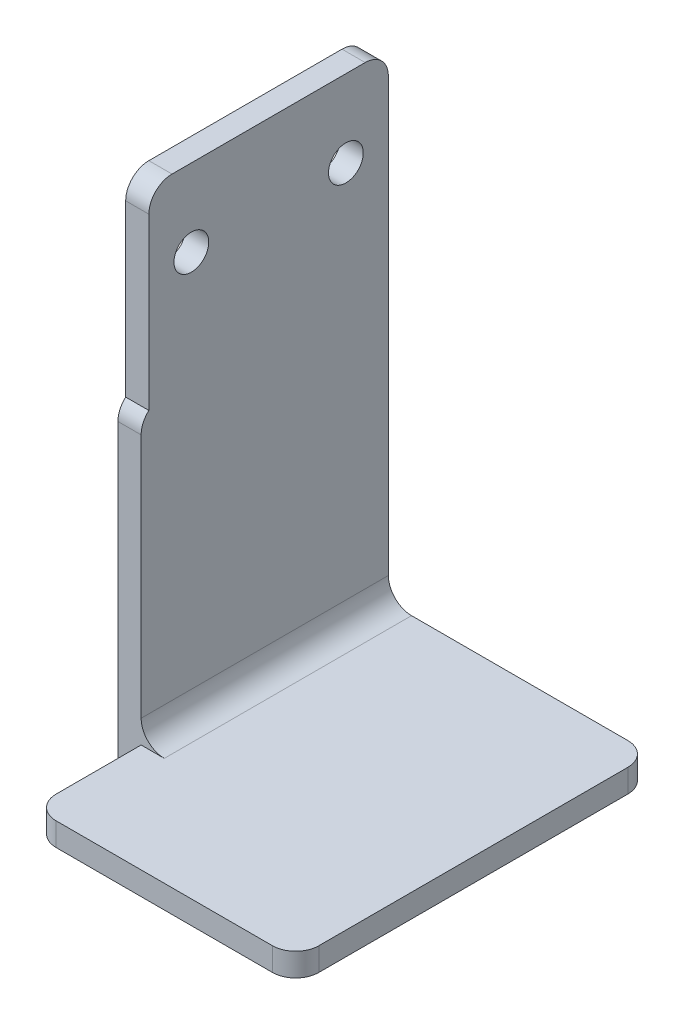
ISO-10303-21;
HEADER;
FILE_DESCRIPTION(('STEP AP214'),'2;1');
FILE_NAME('part.step','',(''),(''),'','','');
FILE_SCHEMA(('AUTOMOTIVE_DESIGN { 1 0 10303 214 1 1 1 1 }'));
ENDSEC;
DATA;
#1=APPLICATION_CONTEXT('core data for automotive mechanical design processes');
#2=APPLICATION_PROTOCOL_DEFINITION('international standard','automotive_design',2000,#1);
#3=PRODUCT_CONTEXT('',#1,'mechanical');
#4=PRODUCT('Part','Part','',(#3));
#5=PRODUCT_RELATED_PRODUCT_CATEGORY('part','',(#4));
#6=PRODUCT_DEFINITION_FORMATION('','',#4);
#7=PRODUCT_DEFINITION_CONTEXT('part definition',#1,'design');
#8=PRODUCT_DEFINITION('design','',#6,#7);
#9=PRODUCT_DEFINITION_SHAPE('','',#8);
#10=(LENGTH_UNIT() NAMED_UNIT(*) SI_UNIT(.MILLI.,.METRE.));
#11=(NAMED_UNIT(*) PLANE_ANGLE_UNIT() SI_UNIT($,.RADIAN.));
#12=(NAMED_UNIT(*) SI_UNIT($,.STERADIAN.) SOLID_ANGLE_UNIT());
#13=UNCERTAINTY_MEASURE_WITH_UNIT(LENGTH_MEASURE(1.E-05),#10,'distance_accuracy_value','');
#14=(GEOMETRIC_REPRESENTATION_CONTEXT(3) GLOBAL_UNCERTAINTY_ASSIGNED_CONTEXT((#13)) GLOBAL_UNIT_ASSIGNED_CONTEXT((#10,
#11,#12)) REPRESENTATION_CONTEXT('',''));
#15=CARTESIAN_POINT('',(0.,0.,0.));
#16=DIRECTION('',(0.,0.,1.));
#17=DIRECTION('',(1.,0.,0.));
#18=AXIS2_PLACEMENT_3D('',#15,#16,#17);
#19=CARTESIAN_POINT('',(0.,0.,46.));
#20=DIRECTION('',(0.,0.,-1.));
#21=DIRECTION('',(-1.,0.,0.));
#22=AXIS2_PLACEMENT_3D('',#19,#20,#21);
#23=PLANE('',#22);
#24=DIRECTION('',(-1.,0.,0.));
#25=VECTOR('',#24,1.);
#26=CARTESIAN_POINT('',(3.00000000000001,3.,46.));
#27=LINE('',#26,#25);
#28=CARTESIAN_POINT('',(34.,3.,46.));
#29=VERTEX_POINT('',#28);
#30=CARTESIAN_POINT('',(6.,3.,46.));
#31=VERTEX_POINT('',#30);
#32=EDGE_CURVE('E253',#29,#31,#27,.T.);
#33=ORIENTED_EDGE('',*,*,#32,.T.);
#34=DIRECTION('',(0.,1.,0.));
#35=VECTOR('',#34,1.);
#36=CARTESIAN_POINT('',(6.,0.,46.));
#37=LINE('',#36,#35);
#38=CARTESIAN_POINT('',(6.00000000000001,0.,46.));
#39=VERTEX_POINT('',#38);
#40=EDGE_CURVE('E202',#31,#39,#37,.F.);
#41=ORIENTED_EDGE('',*,*,#40,.T.);
#42=DIRECTION('',(1.,0.,0.));
#43=VECTOR('',#42,1.);
#44=CARTESIAN_POINT('',(37.,0.,46.));
#45=LINE('',#44,#43);
#46=CARTESIAN_POINT('',(34.,0.,46.));
#47=VERTEX_POINT('',#46);
#48=EDGE_CURVE('E250',#39,#47,#45,.T.);
#49=ORIENTED_EDGE('',*,*,#48,.T.);
#50=DIRECTION('',(0.,1.,0.));
#51=VECTOR('',#50,1.);
#52=CARTESIAN_POINT('',(34.,0.,46.));
#53=LINE('',#52,#51);
#54=EDGE_CURVE('E199',#47,#29,#53,.T.);
#55=ORIENTED_EDGE('',*,*,#54,.T.);
#56=EDGE_LOOP('',(#33,#41,#49,#55));
#57=FACE_BOUND('',#56,.T.);
#58=ADVANCED_FACE('F33',(#57),#23,.F.);
#59=CARTESIAN_POINT('',(37.,0.,46.));
#60=DIRECTION('',(0.,1.,0.));
#61=DIRECTION('',(-1.,0.,0.));
#62=AXIS2_PLACEMENT_3D('',#59,#60,#61);
#63=PLANE('',#62);
#64=ORIENTED_EDGE('',*,*,#48,.F.);
#65=CARTESIAN_POINT('',(6.,0.,43.));
#66=DIRECTION('',(0.,1.,0.));
#67=DIRECTION('',(-1.,0.,0.));
#68=AXIS2_PLACEMENT_3D('',#65,#66,#67);
#69=CIRCLE('',#68,3.);
#70=CARTESIAN_POINT('',(3.,0.,43.));
#71=VERTEX_POINT('',#70);
#72=EDGE_CURVE('E207',#39,#71,#69,.F.);
#73=ORIENTED_EDGE('',*,*,#72,.T.);
#74=DIRECTION('',(0.,0.,1.));
#75=VECTOR('',#74,1.);
#76=CARTESIAN_POINT('',(3.,0.,32.));
#77=LINE('',#76,#75);
#78=CARTESIAN_POINT('',(3.,0.,32.));
#79=VERTEX_POINT('',#78);
#80=EDGE_CURVE('E170',#79,#71,#77,.T.);
#81=ORIENTED_EDGE('',*,*,#80,.F.);
#82=DIRECTION('',(-1.,0.,0.));
#83=VECTOR('',#82,1.);
#84=CARTESIAN_POINT('',(3.,0.,32.));
#85=LINE('',#84,#83);
#86=CARTESIAN_POINT('',(0.,0.,32.));
#87=VERTEX_POINT('',#86);
#88=EDGE_CURVE('E169',#79,#87,#85,.T.);
#89=ORIENTED_EDGE('',*,*,#88,.T.);
#90=DIRECTION('',(0.,0.,-1.));
#91=VECTOR('',#90,1.);
#92=CARTESIAN_POINT('',(0.,0.,46.));
#93=LINE('',#92,#91);
#94=CARTESIAN_POINT('',(0.,0.,0.));
#95=VERTEX_POINT('',#94);
#96=EDGE_CURVE('E257',#87,#95,#93,.T.);
#97=ORIENTED_EDGE('',*,*,#96,.T.);
#98=DIRECTION('',(1.,0.,0.));
#99=VECTOR('',#98,1.);
#100=CARTESIAN_POINT('',(37.,0.,0.));
#101=LINE('',#100,#99);
#102=CARTESIAN_POINT('',(34.,0.,0.));
#103=VERTEX_POINT('',#102);
#104=EDGE_CURVE('E233',#95,#103,#101,.T.);
#105=ORIENTED_EDGE('',*,*,#104,.T.);
#106=CARTESIAN_POINT('',(34.,0.,3.));
#107=DIRECTION('',(0.,1.,0.));
#108=DIRECTION('',(-1.,0.,0.));
#109=AXIS2_PLACEMENT_3D('',#106,#107,#108);
#110=CIRCLE('',#109,3.);
#111=CARTESIAN_POINT('',(37.,0.,3.));
#112=VERTEX_POINT('',#111);
#113=EDGE_CURVE('E48',#103,#112,#110,.F.);
#114=ORIENTED_EDGE('',*,*,#113,.T.);
#115=DIRECTION('',(0.,0.,-1.));
#116=VECTOR('',#115,1.);
#117=CARTESIAN_POINT('',(37.,0.,46.));
#118=LINE('',#117,#116);
#119=CARTESIAN_POINT('',(37.,0.,43.));
#120=VERTEX_POINT('',#119);
#121=EDGE_CURVE('E274',#120,#112,#118,.T.);
#122=ORIENTED_EDGE('',*,*,#121,.F.);
#123=CARTESIAN_POINT('',(34.,0.,43.));
#124=DIRECTION('',(0.,1.,0.));
#125=DIRECTION('',(-1.,0.,0.));
#126=AXIS2_PLACEMENT_3D('',#123,#124,#125);
#127=CIRCLE('',#126,3.);
#128=EDGE_CURVE('E205',#120,#47,#127,.F.);
#129=ORIENTED_EDGE('',*,*,#128,.T.);
#130=EDGE_LOOP('',(#64,#73,#81,#89,#97,#105,#114,#122,#129));
#131=FACE_BOUND('',#130,.T.);
#132=ADVANCED_FACE('F308',(#131),#63,.F.);
#133=CARTESIAN_POINT('',(37.,3.,46.));
#134=DIRECTION('',(-1.,0.,0.));
#135=DIRECTION('',(0.,0.,1.));
#136=AXIS2_PLACEMENT_3D('',#133,#134,#135);
#137=PLANE('',#136);
#138=DIRECTION('',(0.,0.,-1.));
#139=VECTOR('',#138,1.);
#140=CARTESIAN_POINT('',(37.,3.,46.));
#141=LINE('',#140,#139);
#142=CARTESIAN_POINT('',(37.,3.,43.));
#143=VERTEX_POINT('',#142);
#144=CARTESIAN_POINT('',(37.,3.,3.));
#145=VERTEX_POINT('',#144);
#146=EDGE_CURVE('E272',#143,#145,#141,.T.);
#147=ORIENTED_EDGE('',*,*,#146,.F.);
#148=DIRECTION('',(0.,1.,0.));
#149=VECTOR('',#148,1.);
#150=CARTESIAN_POINT('',(37.,3.,43.));
#151=LINE('',#150,#149);
#152=EDGE_CURVE('E55',#143,#120,#151,.F.);
#153=ORIENTED_EDGE('',*,*,#152,.T.);
#154=ORIENTED_EDGE('',*,*,#121,.T.);
#155=DIRECTION('',(0.,1.,0.));
#156=VECTOR('',#155,1.);
#157=CARTESIAN_POINT('',(37.,3.,3.));
#158=LINE('',#157,#156);
#159=EDGE_CURVE('E213',#112,#145,#158,.T.);
#160=ORIENTED_EDGE('',*,*,#159,.T.);
#161=EDGE_LOOP('',(#147,#153,#154,#160));
#162=FACE_BOUND('',#161,.T.);
#163=ADVANCED_FACE('F311',(#162),#137,.F.);
#164=CARTESIAN_POINT('',(3.00000000000001,3.,46.));
#165=DIRECTION('',(0.,-1.,0.));
#166=DIRECTION('',(1.,0.,0.));
#167=AXIS2_PLACEMENT_3D('',#164,#165,#166);
#168=PLANE('',#167);
#169=DIRECTION('',(-1.,0.,0.));
#170=VECTOR('',#169,1.);
#171=CARTESIAN_POINT('',(3.00000000000001,3.,0.));
#172=LINE('',#171,#170);
#173=CARTESIAN_POINT('',(34.,3.,0.));
#174=VERTEX_POINT('',#173);
#175=CARTESIAN_POINT('',(6.00000000000001,3.,0.));
#176=VERTEX_POINT('',#175);
#177=EDGE_CURVE('E222',#174,#176,#172,.T.);
#178=ORIENTED_EDGE('',*,*,#177,.T.);
#179=DIRECTION('',(0.,0.,-1.));
#180=VECTOR('',#179,1.);
#181=CARTESIAN_POINT('',(6.00000000000001,3.,32.));
#182=LINE('',#181,#180);
#183=CARTESIAN_POINT('',(6.00000000000001,3.,32.));
#184=VERTEX_POINT('',#183);
#185=EDGE_CURVE('E193',#176,#184,#182,.F.);
#186=ORIENTED_EDGE('',*,*,#185,.T.);
#187=DIRECTION('',(-1.,0.,0.));
#188=VECTOR('',#187,1.);
#189=CARTESIAN_POINT('',(3.,3.,32.));
#190=LINE('',#189,#188);
#191=CARTESIAN_POINT('',(3.,3.,32.));
#192=VERTEX_POINT('',#191);
#193=EDGE_CURVE('E191',#184,#192,#190,.T.);
#194=ORIENTED_EDGE('',*,*,#193,.T.);
#195=DIRECTION('',(0.,0.,-1.));
#196=VECTOR('',#195,1.);
#197=CARTESIAN_POINT('',(3.00000000000001,3.,46.));
#198=LINE('',#197,#196);
#199=CARTESIAN_POINT('',(3.00000000000001,3.,43.));
#200=VERTEX_POINT('',#199);
#201=EDGE_CURVE('E269',#200,#192,#198,.T.);
#202=ORIENTED_EDGE('',*,*,#201,.F.);
#203=CARTESIAN_POINT('',(6.,3.,43.));
#204=DIRECTION('',(0.,-1.,0.));
#205=DIRECTION('',(1.,0.,0.));
#206=AXIS2_PLACEMENT_3D('',#203,#204,#205);
#207=CIRCLE('',#206,3.);
#208=EDGE_CURVE('E189',#200,#31,#207,.F.);
#209=ORIENTED_EDGE('',*,*,#208,.T.);
#210=ORIENTED_EDGE('',*,*,#32,.F.);
#211=CARTESIAN_POINT('',(34.,3.,43.));
#212=DIRECTION('',(0.,-1.,0.));
#213=DIRECTION('',(1.,0.,0.));
#214=AXIS2_PLACEMENT_3D('',#211,#212,#213);
#215=CIRCLE('',#214,3.);
#216=EDGE_CURVE('E187',#29,#143,#215,.F.);
#217=ORIENTED_EDGE('',*,*,#216,.T.);
#218=ORIENTED_EDGE('',*,*,#146,.T.);
#219=CARTESIAN_POINT('',(34.,3.,3.));
#220=DIRECTION('',(0.,-1.,0.));
#221=DIRECTION('',(1.,0.,0.));
#222=AXIS2_PLACEMENT_3D('',#219,#220,#221);
#223=CIRCLE('',#222,3.);
#224=EDGE_CURVE('E185',#145,#174,#223,.F.);
#225=ORIENTED_EDGE('',*,*,#224,.T.);
#226=EDGE_LOOP('',(#178,#186,#194,#202,#209,#210,#217,#218,#225));
#227=FACE_BOUND('',#226,.T.);
#228=ADVANCED_FACE('F230',(#227),#168,.F.);
#229=CARTESIAN_POINT('',(3.,65.,46.));
#230=DIRECTION('',(-1.,0.,0.));
#231=DIRECTION('',(0.,-1.,0.));
#232=AXIS2_PLACEMENT_3D('',#229,#230,#231);
#233=PLANE('',#232);
#234=CARTESIAN_POINT('',(3.,55.,25.5));
#235=DIRECTION('',(1.,0.,0.));
#236=DIRECTION('',(0.,1.,0.));
#237=AXIS2_PLACEMENT_3D('',#234,#235,#236);
#238=CIRCLE('',#237,2.25);
#239=CARTESIAN_POINT('',(3.,57.25,25.5));
#240=VERTEX_POINT('',#239);
#241=EDGE_CURVE('E280',#240,#240,#238,.T.);
#242=ORIENTED_EDGE('',*,*,#241,.F.);
#243=EDGE_LOOP('',(#242));
#244=FACE_BOUND('',#243,.T.);
#245=CARTESIAN_POINT('',(3.,55.,5.5));
#246=DIRECTION('',(1.,0.,0.));
#247=DIRECTION('',(0.,1.,0.));
#248=AXIS2_PLACEMENT_3D('',#245,#246,#247);
#249=CIRCLE('',#248,2.25);
#250=CARTESIAN_POINT('',(3.,57.25,5.5));
#251=VERTEX_POINT('',#250);
#252=EDGE_CURVE('E498',#251,#251,#249,.T.);
#253=ORIENTED_EDGE('',*,*,#252,.F.);
#254=EDGE_LOOP('',(#253));
#255=FACE_BOUND('',#254,.T.);
#256=DIRECTION('',(0.,0.,-1.));
#257=VECTOR('',#256,1.);
#258=CARTESIAN_POINT('',(3.,65.,46.));
#259=LINE('',#258,#257);
#260=CARTESIAN_POINT('',(3.,65.,28.));
#261=VERTEX_POINT('',#260);
#262=CARTESIAN_POINT('',(3.,65.,3.));
#263=VERTEX_POINT('',#262);
#264=EDGE_CURVE('E266',#261,#263,#259,.T.);
#265=ORIENTED_EDGE('',*,*,#264,.F.);
#266=CARTESIAN_POINT('',(3.,62.,28.));
#267=DIRECTION('',(-1.,0.,0.));
#268=DIRECTION('',(0.,-1.,0.));
#269=AXIS2_PLACEMENT_3D('',#266,#267,#268);
#270=CIRCLE('',#269,3.);
#271=CARTESIAN_POINT('',(3.,62.,31.));
#272=VERTEX_POINT('',#271);
#273=EDGE_CURVE('E155',#261,#272,#270,.F.);
#274=ORIENTED_EDGE('',*,*,#273,.T.);
#275=DIRECTION('',(0.,-1.,0.));
#276=VECTOR('',#275,1.);
#277=CARTESIAN_POINT('',(3.,40.,31.));
#278=LINE('',#277,#276);
#279=CARTESIAN_POINT('',(3.,40.,31.));
#280=VERTEX_POINT('',#279);
#281=EDGE_CURVE('E146',#272,#280,#278,.T.);
#282=ORIENTED_EDGE('',*,*,#281,.T.);
#283=CARTESIAN_POINT('',(3.,37.7639320225002,29.));
#284=DIRECTION('',(-1.,0.,0.));
#285=DIRECTION('',(0.,-1.,0.));
#286=AXIS2_PLACEMENT_3D('',#283,#284,#285);
#287=CIRCLE('',#286,3.);
#288=CARTESIAN_POINT('',(3.,37.7639320225002,32.));
#289=VERTEX_POINT('',#288);
#290=EDGE_CURVE('E152',#280,#289,#287,.F.);
#291=ORIENTED_EDGE('',*,*,#290,.T.);
#292=DIRECTION('',(0.,-1.,0.));
#293=VECTOR('',#292,1.);
#294=CARTESIAN_POINT('',(3.,0.,32.));
#295=LINE('',#294,#293);
#296=CARTESIAN_POINT('',(3.,6.,32.));
#297=VERTEX_POINT('',#296);
#298=EDGE_CURVE('E238',#289,#297,#295,.T.);
#299=ORIENTED_EDGE('',*,*,#298,.T.);
#300=DIRECTION('',(0.,0.,-1.));
#301=VECTOR('',#300,1.);
#302=CARTESIAN_POINT('',(3.00000000000001,6.,0.));
#303=LINE('',#302,#301);
#304=CARTESIAN_POINT('',(3.00000000000001,6.,0.));
#305=VERTEX_POINT('',#304);
#306=EDGE_CURVE('E176',#297,#305,#303,.T.);
#307=ORIENTED_EDGE('',*,*,#306,.T.);
#308=DIRECTION('',(0.,1.,0.));
#309=VECTOR('',#308,1.);
#310=CARTESIAN_POINT('',(3.,65.,0.));
#311=LINE('',#310,#309);
#312=CARTESIAN_POINT('',(3.,62.,0.));
#313=VERTEX_POINT('',#312);
#314=EDGE_CURVE('E225',#305,#313,#311,.T.);
#315=ORIENTED_EDGE('',*,*,#314,.T.);
#316=CARTESIAN_POINT('',(3.,62.,3.));
#317=DIRECTION('',(-1.,0.,0.));
#318=DIRECTION('',(0.,-1.,0.));
#319=AXIS2_PLACEMENT_3D('',#316,#317,#318);
#320=CIRCLE('',#319,3.);
#321=EDGE_CURVE('E180',#313,#263,#320,.F.);
#322=ORIENTED_EDGE('',*,*,#321,.T.);
#323=EDGE_LOOP('',(#265,#274,#282,#291,#299,#307,#315,#322));
#324=FACE_BOUND('',#323,.T.);
#325=ADVANCED_FACE('F149',(#244,#255,#324),#233,.F.);
#326=CARTESIAN_POINT('',(0.,65.,46.));
#327=DIRECTION('',(0.,-1.,0.));
#328=DIRECTION('',(0.,0.,-1.));
#329=AXIS2_PLACEMENT_3D('',#326,#327,#328);
#330=PLANE('',#329);
#331=DIRECTION('',(0.,0.,-1.));
#332=VECTOR('',#331,1.);
#333=CARTESIAN_POINT('',(0.,65.,46.));
#334=LINE('',#333,#332);
#335=CARTESIAN_POINT('',(0.,65.,28.));
#336=VERTEX_POINT('',#335);
#337=CARTESIAN_POINT('',(0.,65.,3.));
#338=VERTEX_POINT('',#337);
#339=EDGE_CURVE('E263',#336,#338,#334,.T.);
#340=ORIENTED_EDGE('',*,*,#339,.F.);
#341=DIRECTION('',(-1.,0.,0.));
#342=VECTOR('',#341,1.);
#343=CARTESIAN_POINT('',(0.,65.,28.));
#344=LINE('',#343,#342);
#345=EDGE_CURVE('E293',#336,#261,#344,.F.);
#346=ORIENTED_EDGE('',*,*,#345,.T.);
#347=ORIENTED_EDGE('',*,*,#264,.T.);
#348=DIRECTION('',(-1.,0.,0.));
#349=VECTOR('',#348,1.);
#350=CARTESIAN_POINT('',(0.,65.,3.));
#351=LINE('',#350,#349);
#352=EDGE_CURVE('E290',#263,#338,#351,.T.);
#353=ORIENTED_EDGE('',*,*,#352,.T.);
#354=EDGE_LOOP('',(#340,#346,#347,#353));
#355=FACE_BOUND('',#354,.T.);
#356=ADVANCED_FACE('F300',(#355),#330,.F.);
#357=CARTESIAN_POINT('',(0.,0.,46.));
#358=DIRECTION('',(1.,0.,0.));
#359=DIRECTION('',(0.,0.,-1.));
#360=AXIS2_PLACEMENT_3D('',#357,#358,#359);
#361=PLANE('',#360);
#362=CARTESIAN_POINT('',(0.,55.,25.5));
#363=DIRECTION('',(1.,0.,0.));
#364=DIRECTION('',(0.,0.,-1.));
#365=AXIS2_PLACEMENT_3D('',#362,#363,#364);
#366=CIRCLE('',#365,2.25);
#367=CARTESIAN_POINT('',(0.,55.,23.25));
#368=VERTEX_POINT('',#367);
#369=EDGE_CURVE('E246',#368,#368,#366,.T.);
#370=ORIENTED_EDGE('',*,*,#369,.T.);
#371=EDGE_LOOP('',(#370));
#372=FACE_BOUND('',#371,.T.);
#373=CARTESIAN_POINT('',(0.,55.,5.5));
#374=DIRECTION('',(1.,0.,0.));
#375=DIRECTION('',(0.,0.,-1.));
#376=AXIS2_PLACEMENT_3D('',#373,#374,#375);
#377=CIRCLE('',#376,2.25);
#378=CARTESIAN_POINT('',(0.,55.,3.25));
#379=VERTEX_POINT('',#378);
#380=EDGE_CURVE('E277',#379,#379,#377,.T.);
#381=ORIENTED_EDGE('',*,*,#380,.T.);
#382=EDGE_LOOP('',(#381));
#383=FACE_BOUND('',#382,.T.);
#384=DIRECTION('',(0.,-1.,0.));
#385=VECTOR('',#384,1.);
#386=CARTESIAN_POINT('',(0.,40.,31.));
#387=LINE('',#386,#385);
#388=CARTESIAN_POINT('',(0.,62.,31.));
#389=VERTEX_POINT('',#388);
#390=CARTESIAN_POINT('',(0.,40.,31.));
#391=VERTEX_POINT('',#390);
#392=EDGE_CURVE('E167',#389,#391,#387,.T.);
#393=ORIENTED_EDGE('',*,*,#392,.F.);
#394=CARTESIAN_POINT('',(0.,62.,28.));
#395=DIRECTION('',(1.,0.,0.));
#396=DIRECTION('',(0.,0.,-1.));
#397=AXIS2_PLACEMENT_3D('',#394,#395,#396);
#398=CIRCLE('',#397,3.);
#399=EDGE_CURVE('E288',#389,#336,#398,.F.);
#400=ORIENTED_EDGE('',*,*,#399,.T.);
#401=ORIENTED_EDGE('',*,*,#339,.T.);
#402=CARTESIAN_POINT('',(0.,62.,3.));
#403=DIRECTION('',(1.,0.,0.));
#404=DIRECTION('',(0.,0.,-1.));
#405=AXIS2_PLACEMENT_3D('',#402,#403,#404);
#406=CIRCLE('',#405,3.);
#407=CARTESIAN_POINT('',(0.,62.,0.));
#408=VERTEX_POINT('',#407);
#409=EDGE_CURVE('E284',#338,#408,#406,.F.);
#410=ORIENTED_EDGE('',*,*,#409,.T.);
#411=DIRECTION('',(0.,-1.,0.));
#412=VECTOR('',#411,1.);
#413=CARTESIAN_POINT('',(0.,0.,0.));
#414=LINE('',#413,#412);
#415=EDGE_CURVE('E254',#408,#95,#414,.T.);
#416=ORIENTED_EDGE('',*,*,#415,.T.);
#417=ORIENTED_EDGE('',*,*,#96,.F.);
#418=DIRECTION('',(0.,-1.,0.));
#419=VECTOR('',#418,1.);
#420=CARTESIAN_POINT('',(0.,0.,32.));
#421=LINE('',#420,#419);
#422=CARTESIAN_POINT('',(0.,37.7639320225002,32.));
#423=VERTEX_POINT('',#422);
#424=EDGE_CURVE('E160',#423,#87,#421,.T.);
#425=ORIENTED_EDGE('',*,*,#424,.F.);
#426=CARTESIAN_POINT('',(0.,37.7639320225002,29.));
#427=DIRECTION('',(1.,0.,0.));
#428=DIRECTION('',(0.,0.,-1.));
#429=AXIS2_PLACEMENT_3D('',#426,#427,#428);
#430=CIRCLE('',#429,3.);
#431=EDGE_CURVE('E286',#423,#391,#430,.F.);
#432=ORIENTED_EDGE('',*,*,#431,.T.);
#433=EDGE_LOOP('',(#393,#400,#401,#410,#416,#417,#425,#432));
#434=FACE_BOUND('',#433,.T.);
#435=ADVANCED_FACE('F304',(#372,#383,#434),#361,.F.);
#436=CARTESIAN_POINT('',(0.,0.,0.));
#437=DIRECTION('',(0.,0.,-1.));
#438=DIRECTION('',(-1.,0.,0.));
#439=AXIS2_PLACEMENT_3D('',#436,#437,#438);
#440=PLANE('',#439);
#441=ORIENTED_EDGE('',*,*,#415,.F.);
#442=DIRECTION('',(-1.,0.,0.));
#443=VECTOR('',#442,1.);
#444=CARTESIAN_POINT('',(3.,62.,0.));
#445=LINE('',#444,#443);
#446=EDGE_CURVE('E211',#408,#313,#445,.F.);
#447=ORIENTED_EDGE('',*,*,#446,.T.);
#448=ORIENTED_EDGE('',*,*,#314,.F.);
#449=CARTESIAN_POINT('',(6.00000000000001,6.,0.));
#450=DIRECTION('',(0.,0.,-1.));
#451=DIRECTION('',(-1.,0.,0.));
#452=AXIS2_PLACEMENT_3D('',#449,#450,#451);
#453=CIRCLE('',#452,3.);
#454=EDGE_CURVE('E41',#305,#176,#453,.F.);
#455=ORIENTED_EDGE('',*,*,#454,.T.);
#456=ORIENTED_EDGE('',*,*,#177,.F.);
#457=DIRECTION('',(0.,1.,0.));
#458=VECTOR('',#457,1.);
#459=CARTESIAN_POINT('',(34.,0.,0.));
#460=LINE('',#459,#458);
#461=EDGE_CURVE('E209',#174,#103,#460,.F.);
#462=ORIENTED_EDGE('',*,*,#461,.T.);
#463=ORIENTED_EDGE('',*,*,#104,.F.);
#464=EDGE_LOOP('',(#441,#447,#448,#455,#456,#462,#463));
#465=FACE_BOUND('',#464,.T.);
#466=ADVANCED_FACE('F221',(#465),#440,.T.);
#467=CARTESIAN_POINT('',(3.,0.,0.));
#468=DIRECTION('',(-1.,0.,0.));
#469=DIRECTION('',(0.,0.,1.));
#470=AXIS2_PLACEMENT_3D('',#467,#468,#469);
#471=PLANE('',#470);
#472=ORIENTED_EDGE('',*,*,#80,.T.);
#473=DIRECTION('',(0.,1.,0.));
#474=VECTOR('',#473,1.);
#475=CARTESIAN_POINT('',(3.,3.,43.));
#476=LINE('',#475,#474);
#477=EDGE_CURVE('E196',#71,#200,#476,.T.);
#478=ORIENTED_EDGE('',*,*,#477,.T.);
#479=ORIENTED_EDGE('',*,*,#201,.T.);
#480=EDGE_CURVE('E159',#192,#79,#295,.T.);
#481=ORIENTED_EDGE('',*,*,#480,.T.);
#482=EDGE_LOOP('',(#472,#478,#479,#481));
#483=FACE_BOUND('',#482,.T.);
#484=ADVANCED_FACE('F326',(#483),#471,.T.);
#485=CARTESIAN_POINT('',(3.,0.,32.));
#486=DIRECTION('',(0.,0.,-1.));
#487=DIRECTION('',(0.,1.,0.));
#488=AXIS2_PLACEMENT_3D('',#485,#486,#487);
#489=PLANE('',#488);
#490=ORIENTED_EDGE('',*,*,#298,.F.);
#491=DIRECTION('',(1.,0.,0.));
#492=VECTOR('',#491,1.);
#493=CARTESIAN_POINT('',(3.,37.7639320225002,32.));
#494=LINE('',#493,#492);
#495=EDGE_CURVE('E175',#289,#423,#494,.F.);
#496=ORIENTED_EDGE('',*,*,#495,.T.);
#497=ORIENTED_EDGE('',*,*,#424,.T.);
#498=ORIENTED_EDGE('',*,*,#88,.F.);
#499=ORIENTED_EDGE('',*,*,#480,.F.);
#500=ORIENTED_EDGE('',*,*,#193,.F.);
#501=CARTESIAN_POINT('',(6.00000000000001,6.,32.));
#502=DIRECTION('',(0.,0.,-1.));
#503=DIRECTION('',(0.,1.,0.));
#504=AXIS2_PLACEMENT_3D('',#501,#502,#503);
#505=CIRCLE('',#504,3.);
#506=EDGE_CURVE('E11',#184,#297,#505,.T.);
#507=ORIENTED_EDGE('',*,*,#506,.T.);
#508=EDGE_LOOP('',(#490,#496,#497,#498,#499,#500,#507));
#509=FACE_BOUND('',#508,.T.);
#510=ADVANCED_FACE('F237',(#509),#489,.F.);
#511=CARTESIAN_POINT('',(3.,40.,31.));
#512=DIRECTION('',(0.,0.,-1.));
#513=DIRECTION('',(-1.,0.,0.));
#514=AXIS2_PLACEMENT_3D('',#511,#512,#513);
#515=PLANE('',#514);
#516=ORIENTED_EDGE('',*,*,#281,.F.);
#517=DIRECTION('',(-1.,0.,0.));
#518=VECTOR('',#517,1.);
#519=CARTESIAN_POINT('',(3.,62.,31.));
#520=LINE('',#519,#518);
#521=EDGE_CURVE('E276',#272,#389,#520,.T.);
#522=ORIENTED_EDGE('',*,*,#521,.T.);
#523=ORIENTED_EDGE('',*,*,#392,.T.);
#524=DIRECTION('',(-1.,0.,0.));
#525=VECTOR('',#524,1.);
#526=CARTESIAN_POINT('',(3.,40.,31.));
#527=LINE('',#526,#525);
#528=EDGE_CURVE('E164',#280,#391,#527,.T.);
#529=ORIENTED_EDGE('',*,*,#528,.F.);
#530=EDGE_LOOP('',(#516,#522,#523,#529));
#531=FACE_BOUND('',#530,.T.);
#532=ADVANCED_FACE('F165',(#531),#515,.F.);
#533=CARTESIAN_POINT('',(-43.,55.,5.5));
#534=DIRECTION('',(1.,0.,0.));
#535=DIRECTION('',(0.,1.,0.));
#536=AXIS2_PLACEMENT_3D('',#533,#534,#535);
#537=CYLINDRICAL_SURFACE('',#536,2.25);
#538=ORIENTED_EDGE('',*,*,#252,.T.);
#539=EDGE_LOOP('',(#538));
#540=FACE_BOUND('',#539,.T.);
#541=ORIENTED_EDGE('',*,*,#380,.F.);
#542=EDGE_LOOP('',(#541));
#543=FACE_BOUND('',#542,.T.);
#544=ADVANCED_FACE('F339',(#540,#543),#537,.F.);
#545=CARTESIAN_POINT('',(-43.,55.,25.5));
#546=DIRECTION('',(1.,0.,0.));
#547=DIRECTION('',(0.,1.,0.));
#548=AXIS2_PLACEMENT_3D('',#545,#546,#547);
#549=CYLINDRICAL_SURFACE('',#548,2.25);
#550=ORIENTED_EDGE('',*,*,#241,.T.);
#551=EDGE_LOOP('',(#550));
#552=FACE_BOUND('',#551,.T.);
#553=ORIENTED_EDGE('',*,*,#369,.F.);
#554=EDGE_LOOP('',(#553));
#555=FACE_BOUND('',#554,.T.);
#556=ADVANCED_FACE('F332',(#552,#555),#549,.F.);
#557=CARTESIAN_POINT('',(3.,62.,28.));
#558=DIRECTION('',(-1.,0.,0.));
#559=DIRECTION('',(0.,0.,1.));
#560=AXIS2_PLACEMENT_3D('',#557,#558,#559);
#561=CYLINDRICAL_SURFACE('',#560,3.);
#562=ORIENTED_EDGE('',*,*,#273,.F.);
#563=ORIENTED_EDGE('',*,*,#345,.F.);
#564=ORIENTED_EDGE('',*,*,#399,.F.);
#565=ORIENTED_EDGE('',*,*,#521,.F.);
#566=EDGE_LOOP('',(#562,#563,#564,#565));
#567=FACE_BOUND('',#566,.T.);
#568=ADVANCED_FACE('F330',(#567),#561,.T.);
#569=CARTESIAN_POINT('',(3.,37.7639320225002,29.));
#570=DIRECTION('',(1.,0.,0.));
#571=DIRECTION('',(0.,0.,-1.));
#572=AXIS2_PLACEMENT_3D('',#569,#570,#571);
#573=CYLINDRICAL_SURFACE('',#572,3.);
#574=ORIENTED_EDGE('',*,*,#290,.F.);
#575=ORIENTED_EDGE('',*,*,#528,.T.);
#576=ORIENTED_EDGE('',*,*,#431,.F.);
#577=ORIENTED_EDGE('',*,*,#495,.F.);
#578=EDGE_LOOP('',(#574,#575,#576,#577));
#579=FACE_BOUND('',#578,.T.);
#580=ADVANCED_FACE('F173',(#579),#573,.T.);
#581=CARTESIAN_POINT('',(6.00000000000001,6.,46.));
#582=DIRECTION('',(0.,0.,1.));
#583=DIRECTION('',(1.,0.,0.));
#584=AXIS2_PLACEMENT_3D('',#581,#582,#583);
#585=CYLINDRICAL_SURFACE('',#584,3.);
#586=ORIENTED_EDGE('',*,*,#506,.F.);
#587=ORIENTED_EDGE('',*,*,#185,.F.);
#588=ORIENTED_EDGE('',*,*,#454,.F.);
#589=ORIENTED_EDGE('',*,*,#306,.F.);
#590=EDGE_LOOP('',(#586,#587,#588,#589));
#591=FACE_BOUND('',#590,.T.);
#592=ADVANCED_FACE('F235',(#591),#585,.F.);
#593=CARTESIAN_POINT('',(6.,0.,43.));
#594=DIRECTION('',(0.,-1.,0.));
#595=DIRECTION('',(0.,0.,-1.));
#596=AXIS2_PLACEMENT_3D('',#593,#594,#595);
#597=CYLINDRICAL_SURFACE('',#596,3.);
#598=ORIENTED_EDGE('',*,*,#72,.F.);
#599=ORIENTED_EDGE('',*,*,#40,.F.);
#600=ORIENTED_EDGE('',*,*,#208,.F.);
#601=ORIENTED_EDGE('',*,*,#477,.F.);
#602=EDGE_LOOP('',(#598,#599,#600,#601));
#603=FACE_BOUND('',#602,.T.);
#604=ADVANCED_FACE('F323',(#603),#597,.T.);
#605=CARTESIAN_POINT('',(0.,62.,3.));
#606=DIRECTION('',(1.,0.,0.));
#607=DIRECTION('',(0.,0.,-1.));
#608=AXIS2_PLACEMENT_3D('',#605,#606,#607);
#609=CYLINDRICAL_SURFACE('',#608,3.);
#610=ORIENTED_EDGE('',*,*,#321,.F.);
#611=ORIENTED_EDGE('',*,*,#446,.F.);
#612=ORIENTED_EDGE('',*,*,#409,.F.);
#613=ORIENTED_EDGE('',*,*,#352,.F.);
#614=EDGE_LOOP('',(#610,#611,#612,#613));
#615=FACE_BOUND('',#614,.T.);
#616=ADVANCED_FACE('F302',(#615),#609,.T.);
#617=CARTESIAN_POINT('',(34.,0.,43.));
#618=DIRECTION('',(0.,1.,0.));
#619=DIRECTION('',(0.,0.,1.));
#620=AXIS2_PLACEMENT_3D('',#617,#618,#619);
#621=CYLINDRICAL_SURFACE('',#620,3.);
#622=ORIENTED_EDGE('',*,*,#128,.F.);
#623=ORIENTED_EDGE('',*,*,#152,.F.);
#624=ORIENTED_EDGE('',*,*,#216,.F.);
#625=ORIENTED_EDGE('',*,*,#54,.F.);
#626=EDGE_LOOP('',(#622,#623,#624,#625));
#627=FACE_BOUND('',#626,.T.);
#628=ADVANCED_FACE('F316',(#627),#621,.T.);
#629=CARTESIAN_POINT('',(34.,3.,3.));
#630=DIRECTION('',(0.,-1.,0.));
#631=DIRECTION('',(0.,0.,-1.));
#632=AXIS2_PLACEMENT_3D('',#629,#630,#631);
#633=CYLINDRICAL_SURFACE('',#632,3.);
#634=ORIENTED_EDGE('',*,*,#113,.F.);
#635=ORIENTED_EDGE('',*,*,#461,.F.);
#636=ORIENTED_EDGE('',*,*,#224,.F.);
#637=ORIENTED_EDGE('',*,*,#159,.F.);
#638=EDGE_LOOP('',(#634,#635,#636,#637));
#639=FACE_BOUND('',#638,.T.);
#640=ADVANCED_FACE('F35',(#639),#633,.T.);
#641=CLOSED_SHELL('',(#58,#132,#163,#228,#325,#356,#435,#466,#484,#510,#532,#544,#556,#568,#580,
#592,#604,#616,#628,#640));
#642=MANIFOLD_SOLID_BREP('B2',#641);
#643=ADVANCED_BREP_SHAPE_REPRESENTATION('',(#18,#642),#14);
#644=SHAPE_DEFINITION_REPRESENTATION(#9,#643);
ENDSEC;
END-ISO-10303-21;
